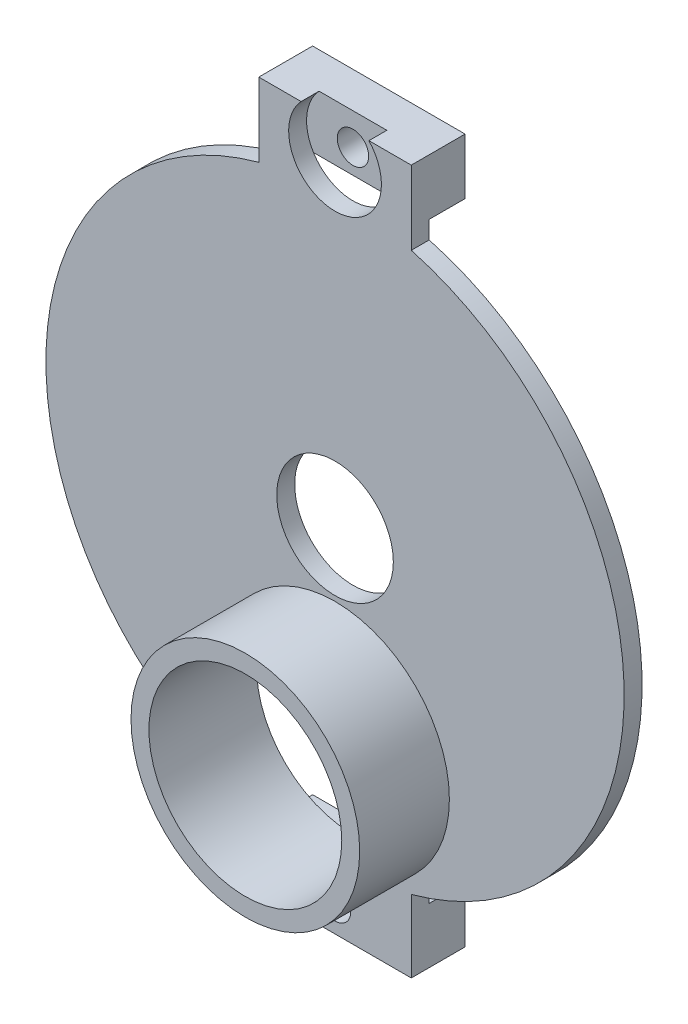
ISO-10303-21;
HEADER;
FILE_DESCRIPTION(('STEP AP214'),'2;1');
FILE_NAME('part.step','',(''),(''),'','','');
FILE_SCHEMA(('AUTOMOTIVE_DESIGN { 1 0 10303 214 1 1 1 1 }'));
ENDSEC;
DATA;
#1=APPLICATION_CONTEXT('core data for automotive mechanical design processes');
#2=APPLICATION_PROTOCOL_DEFINITION('international standard','automotive_design',2000,#1);
#3=PRODUCT_CONTEXT('',#1,'mechanical');
#4=PRODUCT('Part','Part','',(#3));
#5=PRODUCT_RELATED_PRODUCT_CATEGORY('part','',(#4));
#6=PRODUCT_DEFINITION_FORMATION('','',#4);
#7=PRODUCT_DEFINITION_CONTEXT('part definition',#1,'design');
#8=PRODUCT_DEFINITION('design','',#6,#7);
#9=PRODUCT_DEFINITION_SHAPE('','',#8);
#10=(LENGTH_UNIT() NAMED_UNIT(*) SI_UNIT(.MILLI.,.METRE.));
#11=(NAMED_UNIT(*) PLANE_ANGLE_UNIT() SI_UNIT($,.RADIAN.));
#12=(NAMED_UNIT(*) SI_UNIT($,.STERADIAN.) SOLID_ANGLE_UNIT());
#13=UNCERTAINTY_MEASURE_WITH_UNIT(LENGTH_MEASURE(1.E-05),#10,'distance_accuracy_value','');
#14=(GEOMETRIC_REPRESENTATION_CONTEXT(3) GLOBAL_UNCERTAINTY_ASSIGNED_CONTEXT((#13)) GLOBAL_UNIT_ASSIGNED_CONTEXT((#10,
#11,#12)) REPRESENTATION_CONTEXT('',''));
#15=CARTESIAN_POINT('',(0.,0.,0.));
#16=DIRECTION('',(0.,0.,1.));
#17=DIRECTION('',(1.,0.,0.));
#18=AXIS2_PLACEMENT_3D('',#15,#16,#17);
#19=CARTESIAN_POINT('',(0.,-116.80235271561,4.));
#20=DIRECTION('',(0.,0.,-1.));
#21=DIRECTION('',(-1.,0.,0.));
#22=AXIS2_PLACEMENT_3D('',#19,#20,#21);
#23=CYLINDRICAL_SURFACE('',#22,1.75);
#24=CARTESIAN_POINT('',(0.,-116.80235271561,0.));
#25=DIRECTION('',(0.,0.,1.));
#26=DIRECTION('',(1.,0.,0.));
#27=AXIS2_PLACEMENT_3D('',#24,#25,#26);
#28=CIRCLE('',#27,1.75);
#29=CARTESIAN_POINT('',(1.74999999999999,-116.80235271561,0.));
#30=VERTEX_POINT('',#29);
#31=EDGE_CURVE('E196',#30,#30,#28,.T.);
#32=ORIENTED_EDGE('',*,*,#31,.F.);
#33=EDGE_LOOP('',(#32));
#34=FACE_BOUND('',#33,.T.);
#35=CARTESIAN_POINT('',(0.,-116.80235271561,4.));
#36=DIRECTION('',(0.,0.,1.));
#37=DIRECTION('',(1.,0.,0.));
#38=AXIS2_PLACEMENT_3D('',#35,#36,#37);
#39=CIRCLE('',#38,1.75);
#40=CARTESIAN_POINT('',(1.74999999999999,-116.80235271561,4.));
#41=VERTEX_POINT('',#40);
#42=EDGE_CURVE('E218',#41,#41,#39,.T.);
#43=ORIENTED_EDGE('',*,*,#42,.T.);
#44=EDGE_LOOP('',(#43));
#45=FACE_BOUND('',#44,.T.);
#46=ADVANCED_FACE('F40',(#34,#45),#23,.F.);
#47=CARTESIAN_POINT('',(0.,-152.596752449376,6.));
#48=DIRECTION('',(0.,0.,1.));
#49=DIRECTION('',(1.,0.,0.));
#50=AXIS2_PLACEMENT_3D('',#47,#48,#49);
#51=PLANE('',#50);
#52=CARTESIAN_POINT('',(0.,-116.80235271561,6.));
#53=DIRECTION('',(0.,0.,1.));
#54=DIRECTION('',(1.,0.,0.));
#55=AXIS2_PLACEMENT_3D('',#52,#53,#54);
#56=CIRCLE('',#55,5.17155873195874);
#57=CARTESIAN_POINT('',(-3.77892763310191,-113.271810878742,6.));
#58=VERTEX_POINT('',#57);
#59=CARTESIAN_POINT('',(3.77892763310189,-113.271810878742,6.));
#60=VERTEX_POINT('',#59);
#61=EDGE_CURVE('E147',#58,#60,#56,.T.);
#62=ORIENTED_EDGE('',*,*,#61,.F.);
#63=DIRECTION('',(-1.,0.,0.));
#64=VECTOR('',#63,1.);
#65=CARTESIAN_POINT('',(-8.5,-113.271810878742,6.));
#66=LINE('',#65,#64);
#67=CARTESIAN_POINT('',(-8.5,-113.271810878742,6.));
#68=VERTEX_POINT('',#67);
#69=EDGE_CURVE('E167',#58,#68,#66,.T.);
#70=ORIENTED_EDGE('',*,*,#69,.T.);
#71=DIRECTION('',(0.,-1.,0.));
#72=VECTOR('',#71,1.);
#73=CARTESIAN_POINT('',(-8.5,-113.271810878742,6.));
#74=LINE('',#73,#72);
#75=CARTESIAN_POINT('',(-8.5,-121.500854119937,6.));
#76=VERTEX_POINT('',#75);
#77=EDGE_CURVE('E166',#68,#76,#74,.T.);
#78=ORIENTED_EDGE('',*,*,#77,.T.);
#79=CARTESIAN_POINT('',(0.,-152.596752449376,6.));
#80=DIRECTION('',(0.,0.,1.));
#81=DIRECTION('',(1.,0.,0.));
#82=AXIS2_PLACEMENT_3D('',#79,#80,#81);
#83=CIRCLE('',#82,32.2367010240625);
#84=CARTESIAN_POINT('',(-8.5,-183.692650778814,6.));
#85=VERTEX_POINT('',#84);
#86=EDGE_CURVE('E227',#76,#85,#83,.T.);
#87=ORIENTED_EDGE('',*,*,#86,.T.);
#88=DIRECTION('',(0.,-1.,0.));
#89=VECTOR('',#88,1.);
#90=CARTESIAN_POINT('',(-8.5,-191.764216674185,6.));
#91=LINE('',#90,#89);
#92=CARTESIAN_POINT('',(-8.5,-191.764216674185,6.));
#93=VERTEX_POINT('',#92);
#94=EDGE_CURVE('E239',#85,#93,#91,.T.);
#95=ORIENTED_EDGE('',*,*,#94,.T.);
#96=DIRECTION('',(1.,0.,0.));
#97=VECTOR('',#96,1.);
#98=CARTESIAN_POINT('',(8.5,-191.764216674185,6.));
#99=LINE('',#98,#97);
#100=CARTESIAN_POINT('',(8.5,-191.764216674185,6.));
#101=VERTEX_POINT('',#100);
#102=EDGE_CURVE('E241',#93,#101,#99,.T.);
#103=ORIENTED_EDGE('',*,*,#102,.T.);
#104=DIRECTION('',(0.,1.,0.));
#105=VECTOR('',#104,1.);
#106=CARTESIAN_POINT('',(8.5,-191.764216674185,6.));
#107=LINE('',#106,#105);
#108=CARTESIAN_POINT('',(8.50000000000001,-183.692650778814,6.));
#109=VERTEX_POINT('',#108);
#110=EDGE_CURVE('E247',#101,#109,#107,.T.);
#111=ORIENTED_EDGE('',*,*,#110,.T.);
#112=CARTESIAN_POINT('',(0.,-152.596752449376,6.));
#113=DIRECTION('',(0.,0.,1.));
#114=DIRECTION('',(1.,0.,0.));
#115=AXIS2_PLACEMENT_3D('',#112,#113,#114);
#116=CIRCLE('',#115,32.2367010240625);
#117=CARTESIAN_POINT('',(8.5,-121.500854119937,6.));
#118=VERTEX_POINT('',#117);
#119=EDGE_CURVE('E248',#109,#118,#116,.T.);
#120=ORIENTED_EDGE('',*,*,#119,.T.);
#121=DIRECTION('',(0.,1.,0.));
#122=VECTOR('',#121,1.);
#123=CARTESIAN_POINT('',(8.5,-113.271810878742,6.));
#124=LINE('',#123,#122);
#125=CARTESIAN_POINT('',(8.5,-113.271810878742,6.));
#126=VERTEX_POINT('',#125);
#127=EDGE_CURVE('E165',#118,#126,#124,.T.);
#128=ORIENTED_EDGE('',*,*,#127,.T.);
#129=EDGE_CURVE('E159',#126,#60,#66,.T.);
#130=ORIENTED_EDGE('',*,*,#129,.T.);
#131=EDGE_LOOP('',(#62,#70,#78,#87,#95,#103,#111,#120,#128,#130));
#132=FACE_BOUND('',#131,.T.);
#133=CARTESIAN_POINT('',(0.,-188.764216674185,6.));
#134=DIRECTION('',(0.,0.,1.));
#135=DIRECTION('',(1.,0.,0.));
#136=AXIS2_PLACEMENT_3D('',#133,#134,#135);
#137=CIRCLE('',#136,1.75);
#138=CARTESIAN_POINT('',(1.74999999999996,-188.764216674185,6.));
#139=VERTEX_POINT('',#138);
#140=EDGE_CURVE('E309',#139,#139,#137,.T.);
#141=ORIENTED_EDGE('',*,*,#140,.F.);
#142=EDGE_LOOP('',(#141));
#143=FACE_BOUND('',#142,.T.);
#144=CARTESIAN_POINT('',(0.,-152.596752449376,6.));
#145=DIRECTION('',(0.,0.,1.));
#146=DIRECTION('',(1.,0.,0.));
#147=AXIS2_PLACEMENT_3D('',#144,#145,#146);
#148=CIRCLE('',#147,6.5);
#149=CARTESIAN_POINT('',(6.49999999999992,-152.596752449376,6.));
#150=VERTEX_POINT('',#149);
#151=EDGE_CURVE('E352',#150,#150,#148,.T.);
#152=ORIENTED_EDGE('',*,*,#151,.F.);
#153=EDGE_LOOP('',(#152));
#154=FACE_BOUND('',#153,.T.);
#155=CARTESIAN_POINT('',(0.,-172.399709936052,6.));
#156=DIRECTION('',(0.,0.,1.));
#157=DIRECTION('',(1.,0.,0.));
#158=AXIS2_PLACEMENT_3D('',#155,#156,#157);
#159=CIRCLE('',#158,12.75);
#160=CARTESIAN_POINT('',(12.75,-172.399709936052,6.));
#161=VERTEX_POINT('',#160);
#162=EDGE_CURVE('E343',#161,#161,#159,.T.);
#163=ORIENTED_EDGE('',*,*,#162,.F.);
#164=EDGE_LOOP('',(#163));
#165=FACE_BOUND('',#164,.T.);
#166=ADVANCED_FACE('F162',(#132,#143,#154,#165),#51,.T.);
#167=CARTESIAN_POINT('',(0.,-152.596752449376,4.));
#168=DIRECTION('',(0.,0.,1.));
#169=DIRECTION('',(1.,0.,0.));
#170=AXIS2_PLACEMENT_3D('',#167,#168,#169);
#171=PLANE('',#170);
#172=CARTESIAN_POINT('',(0.,-152.596752449376,4.));
#173=DIRECTION('',(0.,0.,1.));
#174=DIRECTION('',(1.,0.,0.));
#175=AXIS2_PLACEMENT_3D('',#172,#173,#174);
#176=CIRCLE('',#175,6.5);
#177=CARTESIAN_POINT('',(6.49999999999992,-152.596752449376,4.));
#178=VERTEX_POINT('',#177);
#179=EDGE_CURVE('E355',#178,#178,#176,.T.);
#180=ORIENTED_EDGE('',*,*,#179,.T.);
#181=EDGE_LOOP('',(#180));
#182=FACE_BOUND('',#181,.T.);
#183=CARTESIAN_POINT('',(0.,-172.399709936052,4.));
#184=DIRECTION('',(0.,0.,1.));
#185=DIRECTION('',(1.,0.,0.));
#186=AXIS2_PLACEMENT_3D('',#183,#184,#185);
#187=CIRCLE('',#186,10.75);
#188=CARTESIAN_POINT('',(10.75,-172.399709936052,4.));
#189=VERTEX_POINT('',#188);
#190=EDGE_CURVE('E178',#189,#189,#187,.T.);
#191=ORIENTED_EDGE('',*,*,#190,.T.);
#192=EDGE_LOOP('',(#191));
#193=FACE_BOUND('',#192,.T.);
#194=DIRECTION('',(1.,0.,0.));
#195=VECTOR('',#194,1.);
#196=CARTESIAN_POINT('',(-8.5,-119.509704073762,4.));
#197=LINE('',#196,#195);
#198=CARTESIAN_POINT('',(-8.5,-119.509704073762,4.));
#199=VERTEX_POINT('',#198);
#200=CARTESIAN_POINT('',(-4.40627601741147,-119.509704073762,4.));
#201=VERTEX_POINT('',#200);
#202=EDGE_CURVE('E205',#199,#201,#197,.T.);
#203=ORIENTED_EDGE('',*,*,#202,.T.);
#204=CARTESIAN_POINT('',(0.,-116.80235271561,4.));
#205=DIRECTION('',(0.,0.,1.));
#206=DIRECTION('',(1.,0.,0.));
#207=AXIS2_PLACEMENT_3D('',#204,#205,#206);
#208=CIRCLE('',#207,5.17155873195874);
#209=CARTESIAN_POINT('',(4.40627601741145,-119.509704073762,4.));
#210=VERTEX_POINT('',#209);
#211=EDGE_CURVE('E287',#201,#210,#208,.T.);
#212=ORIENTED_EDGE('',*,*,#211,.T.);
#213=CARTESIAN_POINT('',(8.5,-119.509704073762,4.));
#214=VERTEX_POINT('',#213);
#215=EDGE_CURVE('E44',#210,#214,#197,.T.);
#216=ORIENTED_EDGE('',*,*,#215,.T.);
#217=DIRECTION('',(0.,1.,0.));
#218=VECTOR('',#217,1.);
#219=CARTESIAN_POINT('',(8.5,-113.271810878742,4.));
#220=LINE('',#219,#218);
#221=CARTESIAN_POINT('',(8.5,-121.500854119937,4.));
#222=VERTEX_POINT('',#221);
#223=EDGE_CURVE('E185',#222,#214,#220,.T.);
#224=ORIENTED_EDGE('',*,*,#223,.F.);
#225=CARTESIAN_POINT('',(0.,-152.596752449376,4.));
#226=DIRECTION('',(0.,0.,1.));
#227=DIRECTION('',(1.,0.,0.));
#228=AXIS2_PLACEMENT_3D('',#225,#226,#227);
#229=CIRCLE('',#228,32.2367010240625);
#230=CARTESIAN_POINT('',(8.50000000000001,-183.692650778814,4.));
#231=VERTEX_POINT('',#230);
#232=EDGE_CURVE('E183',#231,#222,#229,.T.);
#233=ORIENTED_EDGE('',*,*,#232,.F.);
#234=DIRECTION('',(0.,1.,0.));
#235=VECTOR('',#234,1.);
#236=CARTESIAN_POINT('',(8.5,-191.764216674185,4.));
#237=LINE('',#236,#235);
#238=CARTESIAN_POINT('',(8.5,-185.563577972153,4.));
#239=VERTEX_POINT('',#238);
#240=EDGE_CURVE('E181',#239,#231,#237,.T.);
#241=ORIENTED_EDGE('',*,*,#240,.F.);
#242=DIRECTION('',(-1.,0.,0.));
#243=VECTOR('',#242,1.);
#244=CARTESIAN_POINT('',(8.5,-185.563577972153,4.));
#245=LINE('',#244,#243);
#246=CARTESIAN_POINT('',(-8.5,-185.563577972153,4.));
#247=VERTEX_POINT('',#246);
#248=EDGE_CURVE('E291',#239,#247,#245,.T.);
#249=ORIENTED_EDGE('',*,*,#248,.T.);
#250=DIRECTION('',(0.,-1.,0.));
#251=VECTOR('',#250,1.);
#252=CARTESIAN_POINT('',(-8.5,-191.764216674185,4.));
#253=LINE('',#252,#251);
#254=CARTESIAN_POINT('',(-8.5,-183.692650778814,4.));
#255=VERTEX_POINT('',#254);
#256=EDGE_CURVE('E177',#255,#247,#253,.T.);
#257=ORIENTED_EDGE('',*,*,#256,.F.);
#258=CARTESIAN_POINT('',(0.,-152.596752449376,4.));
#259=DIRECTION('',(0.,0.,1.));
#260=DIRECTION('',(1.,0.,0.));
#261=AXIS2_PLACEMENT_3D('',#258,#259,#260);
#262=CIRCLE('',#261,32.2367010240625);
#263=CARTESIAN_POINT('',(-8.5,-121.500854119937,4.));
#264=VERTEX_POINT('',#263);
#265=EDGE_CURVE('E174',#264,#255,#262,.T.);
#266=ORIENTED_EDGE('',*,*,#265,.F.);
#267=DIRECTION('',(0.,-1.,0.));
#268=VECTOR('',#267,1.);
#269=CARTESIAN_POINT('',(-8.5,-113.271810878742,4.));
#270=LINE('',#269,#268);
#271=EDGE_CURVE('E194',#199,#264,#270,.T.);
#272=ORIENTED_EDGE('',*,*,#271,.F.);
#273=EDGE_LOOP('',(#203,#212,#216,#224,#233,#241,#249,#257,#266,#272));
#274=FACE_BOUND('',#273,.T.);
#275=ADVANCED_FACE('F286',(#182,#193,#274),#171,.F.);
#276=CARTESIAN_POINT('',(0.,0.,0.));
#277=DIRECTION('',(0.,0.,1.));
#278=DIRECTION('',(1.,0.,0.));
#279=AXIS2_PLACEMENT_3D('',#276,#277,#278);
#280=PLANE('',#279);
#281=DIRECTION('',(0.,-1.,0.));
#282=VECTOR('',#281,1.);
#283=CARTESIAN_POINT('',(-8.5,-113.271810878742,0.));
#284=LINE('',#283,#282);
#285=CARTESIAN_POINT('',(-8.5,-113.271810878742,0.));
#286=VERTEX_POINT('',#285);
#287=CARTESIAN_POINT('',(-8.5,-119.509704073762,0.));
#288=VERTEX_POINT('',#287);
#289=EDGE_CURVE('E198',#286,#288,#284,.T.);
#290=ORIENTED_EDGE('',*,*,#289,.F.);
#291=DIRECTION('',(-1.,0.,0.));
#292=VECTOR('',#291,1.);
#293=CARTESIAN_POINT('',(-8.5,-113.271810878742,0.));
#294=LINE('',#293,#292);
#295=CARTESIAN_POINT('',(8.5,-113.271810878742,0.));
#296=VERTEX_POINT('',#295);
#297=EDGE_CURVE('E271',#296,#286,#294,.T.);
#298=ORIENTED_EDGE('',*,*,#297,.F.);
#299=DIRECTION('',(0.,1.,0.));
#300=VECTOR('',#299,1.);
#301=CARTESIAN_POINT('',(8.5,-113.271810878742,0.));
#302=LINE('',#301,#300);
#303=CARTESIAN_POINT('',(8.5,-119.509704073762,0.));
#304=VERTEX_POINT('',#303);
#305=EDGE_CURVE('E266',#304,#296,#302,.T.);
#306=ORIENTED_EDGE('',*,*,#305,.F.);
#307=DIRECTION('',(1.,0.,0.));
#308=VECTOR('',#307,1.);
#309=CARTESIAN_POINT('',(-8.5,-119.509704073762,0.));
#310=LINE('',#309,#308);
#311=EDGE_CURVE('E273',#288,#304,#310,.T.);
#312=ORIENTED_EDGE('',*,*,#311,.F.);
#313=EDGE_LOOP('',(#290,#298,#306,#312));
#314=FACE_BOUND('',#313,.T.);
#315=ORIENTED_EDGE('',*,*,#31,.T.);
#316=EDGE_LOOP('',(#315));
#317=FACE_BOUND('',#316,.T.);
#318=ADVANCED_FACE('F278',(#314,#317),#280,.F.);
#319=CARTESIAN_POINT('',(-8.5,-113.271810878742,4.));
#320=DIRECTION('',(1.,0.,0.));
#321=DIRECTION('',(0.,0.,-1.));
#322=AXIS2_PLACEMENT_3D('',#319,#320,#321);
#323=PLANE('',#322);
#324=ORIENTED_EDGE('',*,*,#289,.T.);
#325=DIRECTION('',(0.,0.,-1.));
#326=VECTOR('',#325,1.);
#327=CARTESIAN_POINT('',(-8.5,-119.509704073762,4.));
#328=LINE('',#327,#326);
#329=EDGE_CURVE('E212',#199,#288,#328,.T.);
#330=ORIENTED_EDGE('',*,*,#329,.F.);
#331=ORIENTED_EDGE('',*,*,#271,.T.);
#332=DIRECTION('',(0.,0.,-1.));
#333=VECTOR('',#332,1.);
#334=CARTESIAN_POINT('',(-8.5,-121.500854119937,6.));
#335=LINE('',#334,#333);
#336=EDGE_CURVE('E169',#76,#264,#335,.T.);
#337=ORIENTED_EDGE('',*,*,#336,.F.);
#338=ORIENTED_EDGE('',*,*,#77,.F.);
#339=DIRECTION('',(0.,0.,-1.));
#340=VECTOR('',#339,1.);
#341=CARTESIAN_POINT('',(-8.5,-113.271810878742,4.));
#342=LINE('',#341,#340);
#343=EDGE_CURVE('E209',#68,#286,#342,.T.);
#344=ORIENTED_EDGE('',*,*,#343,.T.);
#345=EDGE_LOOP('',(#324,#330,#331,#337,#338,#344));
#346=FACE_BOUND('',#345,.T.);
#347=ADVANCED_FACE('F42',(#346),#323,.F.);
#348=CARTESIAN_POINT('',(-8.5,-119.509704073762,4.));
#349=DIRECTION('',(0.,1.,0.));
#350=DIRECTION('',(0.,0.,1.));
#351=AXIS2_PLACEMENT_3D('',#348,#349,#350);
#352=PLANE('',#351);
#353=ORIENTED_EDGE('',*,*,#311,.T.);
#354=DIRECTION('',(0.,0.,-1.));
#355=VECTOR('',#354,1.);
#356=CARTESIAN_POINT('',(8.5,-119.509704073762,4.));
#357=LINE('',#356,#355);
#358=EDGE_CURVE('E215',#214,#304,#357,.T.);
#359=ORIENTED_EDGE('',*,*,#358,.F.);
#360=ORIENTED_EDGE('',*,*,#215,.F.);
#361=DIRECTION('',(1.,0.,0.));
#362=VECTOR('',#361,1.);
#363=CARTESIAN_POINT('',(-8.5,-119.509704073762,4.));
#364=LINE('',#363,#362);
#365=EDGE_CURVE('E283',#201,#210,#364,.T.);
#366=ORIENTED_EDGE('',*,*,#365,.F.);
#367=ORIENTED_EDGE('',*,*,#202,.F.);
#368=ORIENTED_EDGE('',*,*,#329,.T.);
#369=EDGE_LOOP('',(#353,#359,#360,#366,#367,#368));
#370=FACE_BOUND('',#369,.T.);
#371=ADVANCED_FACE('F280',(#370),#352,.F.);
#372=CARTESIAN_POINT('',(8.5,-113.271810878742,4.));
#373=DIRECTION('',(-1.,0.,0.));
#374=DIRECTION('',(0.,0.,1.));
#375=AXIS2_PLACEMENT_3D('',#372,#373,#374);
#376=PLANE('',#375);
#377=ORIENTED_EDGE('',*,*,#305,.T.);
#378=DIRECTION('',(0.,0.,-1.));
#379=VECTOR('',#378,1.);
#380=CARTESIAN_POINT('',(8.5,-113.271810878742,4.));
#381=LINE('',#380,#379);
#382=EDGE_CURVE('E263',#126,#296,#381,.T.);
#383=ORIENTED_EDGE('',*,*,#382,.F.);
#384=ORIENTED_EDGE('',*,*,#127,.F.);
#385=DIRECTION('',(0.,0.,-1.));
#386=VECTOR('',#385,1.);
#387=CARTESIAN_POINT('',(8.5,-121.500854119937,6.));
#388=LINE('',#387,#386);
#389=EDGE_CURVE('E236',#118,#222,#388,.T.);
#390=ORIENTED_EDGE('',*,*,#389,.T.);
#391=ORIENTED_EDGE('',*,*,#223,.T.);
#392=ORIENTED_EDGE('',*,*,#358,.T.);
#393=EDGE_LOOP('',(#377,#383,#384,#390,#391,#392));
#394=FACE_BOUND('',#393,.T.);
#395=ADVANCED_FACE('F262',(#394),#376,.F.);
#396=CARTESIAN_POINT('',(-8.5,-113.271810878742,4.));
#397=DIRECTION('',(0.,-1.,0.));
#398=DIRECTION('',(0.,0.,-1.));
#399=AXIS2_PLACEMENT_3D('',#396,#397,#398);
#400=PLANE('',#399);
#401=DIRECTION('',(-1.,0.,0.));
#402=VECTOR('',#401,1.);
#403=CARTESIAN_POINT('',(-8.5,-113.271810878742,4.));
#404=LINE('',#403,#402);
#405=CARTESIAN_POINT('',(3.77892763310189,-113.271810878742,4.));
#406=VERTEX_POINT('',#405);
#407=CARTESIAN_POINT('',(-3.77892763310191,-113.271810878742,4.));
#408=VERTEX_POINT('',#407);
#409=EDGE_CURVE('E160',#406,#408,#404,.T.);
#410=ORIENTED_EDGE('',*,*,#409,.F.);
#411=DIRECTION('',(0.,0.,1.));
#412=VECTOR('',#411,1.);
#413=CARTESIAN_POINT('',(3.77892763310189,-113.271810878742,4.));
#414=LINE('',#413,#412);
#415=EDGE_CURVE('E12',#406,#60,#414,.T.);
#416=ORIENTED_EDGE('',*,*,#415,.T.);
#417=ORIENTED_EDGE('',*,*,#129,.F.);
#418=ORIENTED_EDGE('',*,*,#382,.T.);
#419=ORIENTED_EDGE('',*,*,#297,.T.);
#420=ORIENTED_EDGE('',*,*,#343,.F.);
#421=ORIENTED_EDGE('',*,*,#69,.F.);
#422=DIRECTION('',(0.,0.,1.));
#423=VECTOR('',#422,1.);
#424=CARTESIAN_POINT('',(-3.77892763310191,-113.271810878742,4.));
#425=LINE('',#424,#423);
#426=EDGE_CURVE('E50',#58,#408,#425,.F.);
#427=ORIENTED_EDGE('',*,*,#426,.T.);
#428=EDGE_LOOP('',(#410,#416,#417,#418,#419,#420,#421,#427));
#429=FACE_BOUND('',#428,.T.);
#430=ADVANCED_FACE('F157',(#429),#400,.F.);
#431=CARTESIAN_POINT('',(0.,-152.596752449376,6.));
#432=DIRECTION('',(0.,0.,-1.));
#433=DIRECTION('',(-1.,0.,0.));
#434=AXIS2_PLACEMENT_3D('',#431,#432,#433);
#435=CYLINDRICAL_SURFACE('',#434,32.2367010240625);
#436=ORIENTED_EDGE('',*,*,#265,.T.);
#437=DIRECTION('',(0.,0.,-1.));
#438=VECTOR('',#437,1.);
#439=CARTESIAN_POINT('',(-8.5,-183.692650778814,6.));
#440=LINE('',#439,#438);
#441=EDGE_CURVE('E199',#85,#255,#440,.T.);
#442=ORIENTED_EDGE('',*,*,#441,.F.);
#443=ORIENTED_EDGE('',*,*,#86,.F.);
#444=ORIENTED_EDGE('',*,*,#336,.T.);
#445=EDGE_LOOP('',(#436,#442,#443,#444));
#446=FACE_BOUND('',#445,.T.);
#447=ADVANCED_FACE('F237',(#446),#435,.T.);
#448=CARTESIAN_POINT('',(-8.5,-191.764216674185,6.));
#449=DIRECTION('',(1.,0.,0.));
#450=DIRECTION('',(0.,1.,0.));
#451=AXIS2_PLACEMENT_3D('',#448,#449,#450);
#452=PLANE('',#451);
#453=ORIENTED_EDGE('',*,*,#256,.T.);
#454=DIRECTION('',(0.,0.,-1.));
#455=VECTOR('',#454,1.);
#456=CARTESIAN_POINT('',(-8.5,-185.563577972153,4.));
#457=LINE('',#456,#455);
#458=CARTESIAN_POINT('',(-8.5,-185.563577972153,0.));
#459=VERTEX_POINT('',#458);
#460=EDGE_CURVE('E310',#247,#459,#457,.T.);
#461=ORIENTED_EDGE('',*,*,#460,.T.);
#462=DIRECTION('',(0.,-1.,0.));
#463=VECTOR('',#462,1.);
#464=CARTESIAN_POINT('',(-8.5,-191.764216674185,0.));
#465=LINE('',#464,#463);
#466=CARTESIAN_POINT('',(-8.5,-191.764216674185,0.));
#467=VERTEX_POINT('',#466);
#468=EDGE_CURVE('E317',#459,#467,#465,.T.);
#469=ORIENTED_EDGE('',*,*,#468,.T.);
#470=DIRECTION('',(0.,0.,-1.));
#471=VECTOR('',#470,1.);
#472=CARTESIAN_POINT('',(-8.5,-191.764216674185,6.));
#473=LINE('',#472,#471);
#474=EDGE_CURVE('E296',#93,#467,#473,.T.);
#475=ORIENTED_EDGE('',*,*,#474,.F.);
#476=ORIENTED_EDGE('',*,*,#94,.F.);
#477=ORIENTED_EDGE('',*,*,#441,.T.);
#478=EDGE_LOOP('',(#453,#461,#469,#475,#476,#477));
#479=FACE_BOUND('',#478,.T.);
#480=ADVANCED_FACE('F294',(#479),#452,.F.);
#481=CARTESIAN_POINT('',(8.5,-191.764216674185,6.));
#482=DIRECTION('',(0.,1.,0.));
#483=DIRECTION('',(0.,0.,1.));
#484=AXIS2_PLACEMENT_3D('',#481,#482,#483);
#485=PLANE('',#484);
#486=ORIENTED_EDGE('',*,*,#474,.T.);
#487=DIRECTION('',(1.,0.,0.));
#488=VECTOR('',#487,1.);
#489=CARTESIAN_POINT('',(8.5,-191.764216674185,0.));
#490=LINE('',#489,#488);
#491=CARTESIAN_POINT('',(8.5,-191.764216674185,0.));
#492=VERTEX_POINT('',#491);
#493=EDGE_CURVE('E313',#467,#492,#490,.T.);
#494=ORIENTED_EDGE('',*,*,#493,.T.);
#495=DIRECTION('',(0.,0.,-1.));
#496=VECTOR('',#495,1.);
#497=CARTESIAN_POINT('',(8.5,-191.764216674185,6.));
#498=LINE('',#497,#496);
#499=EDGE_CURVE('E297',#101,#492,#498,.T.);
#500=ORIENTED_EDGE('',*,*,#499,.F.);
#501=ORIENTED_EDGE('',*,*,#102,.F.);
#502=EDGE_LOOP('',(#486,#494,#500,#501));
#503=FACE_BOUND('',#502,.T.);
#504=ADVANCED_FACE('F490',(#503),#485,.F.);
#505=CARTESIAN_POINT('',(8.5,-191.764216674185,6.));
#506=DIRECTION('',(-1.,0.,0.));
#507=DIRECTION('',(0.,-1.,0.));
#508=AXIS2_PLACEMENT_3D('',#505,#506,#507);
#509=PLANE('',#508);
#510=ORIENTED_EDGE('',*,*,#499,.T.);
#511=DIRECTION('',(0.,1.,0.));
#512=VECTOR('',#511,1.);
#513=CARTESIAN_POINT('',(8.5,-191.764216674185,0.));
#514=LINE('',#513,#512);
#515=CARTESIAN_POINT('',(8.5,-185.563577972153,0.));
#516=VERTEX_POINT('',#515);
#517=EDGE_CURVE('E307',#492,#516,#514,.T.);
#518=ORIENTED_EDGE('',*,*,#517,.T.);
#519=DIRECTION('',(0.,0.,-1.));
#520=VECTOR('',#519,1.);
#521=CARTESIAN_POINT('',(8.5,-185.563577972153,4.));
#522=LINE('',#521,#520);
#523=EDGE_CURVE('E305',#239,#516,#522,.T.);
#524=ORIENTED_EDGE('',*,*,#523,.F.);
#525=ORIENTED_EDGE('',*,*,#240,.T.);
#526=DIRECTION('',(0.,0.,-1.));
#527=VECTOR('',#526,1.);
#528=CARTESIAN_POINT('',(8.50000000000001,-183.692650778814,6.));
#529=LINE('',#528,#527);
#530=EDGE_CURVE('E260',#109,#231,#529,.T.);
#531=ORIENTED_EDGE('',*,*,#530,.F.);
#532=ORIENTED_EDGE('',*,*,#110,.F.);
#533=EDGE_LOOP('',(#510,#518,#524,#525,#531,#532));
#534=FACE_BOUND('',#533,.T.);
#535=ADVANCED_FACE('F302',(#534),#509,.F.);
#536=CARTESIAN_POINT('',(0.,-152.596752449376,6.));
#537=DIRECTION('',(0.,0.,-1.));
#538=DIRECTION('',(-1.,0.,0.));
#539=AXIS2_PLACEMENT_3D('',#536,#537,#538);
#540=CYLINDRICAL_SURFACE('',#539,32.2367010240625);
#541=ORIENTED_EDGE('',*,*,#232,.T.);
#542=ORIENTED_EDGE('',*,*,#389,.F.);
#543=ORIENTED_EDGE('',*,*,#119,.F.);
#544=ORIENTED_EDGE('',*,*,#530,.T.);
#545=EDGE_LOOP('',(#541,#542,#543,#544));
#546=FACE_BOUND('',#545,.T.);
#547=ADVANCED_FACE('F256',(#546),#540,.T.);
#548=CARTESIAN_POINT('',(0.,-172.399709936052,6.));
#549=DIRECTION('',(0.,0.,-1.));
#550=DIRECTION('',(-1.,0.,0.));
#551=AXIS2_PLACEMENT_3D('',#548,#549,#550);
#552=CYLINDRICAL_SURFACE('',#551,10.75);
#553=ORIENTED_EDGE('',*,*,#190,.F.);
#554=EDGE_LOOP('',(#553));
#555=FACE_BOUND('',#554,.T.);
#556=CARTESIAN_POINT('',(0.,-172.399709936052,16.));
#557=DIRECTION('',(0.,0.,1.));
#558=DIRECTION('',(1.,0.,0.));
#559=AXIS2_PLACEMENT_3D('',#556,#557,#558);
#560=CIRCLE('',#559,10.75);
#561=CARTESIAN_POINT('',(10.75,-172.399709936052,16.));
#562=VERTEX_POINT('',#561);
#563=EDGE_CURVE('E341',#562,#562,#560,.T.);
#564=ORIENTED_EDGE('',*,*,#563,.T.);
#565=EDGE_LOOP('',(#564));
#566=FACE_BOUND('',#565,.T.);
#567=ADVANCED_FACE('F334',(#555,#566),#552,.F.);
#568=CARTESIAN_POINT('',(0.,-188.764216674185,6.));
#569=DIRECTION('',(0.,0.,-1.));
#570=DIRECTION('',(-1.,0.,0.));
#571=AXIS2_PLACEMENT_3D('',#568,#569,#570);
#572=CYLINDRICAL_SURFACE('',#571,1.75);
#573=ORIENTED_EDGE('',*,*,#140,.T.);
#574=EDGE_LOOP('',(#573));
#575=FACE_BOUND('',#574,.T.);
#576=CARTESIAN_POINT('',(0.,-188.764216674185,0.));
#577=DIRECTION('',(0.,0.,1.));
#578=DIRECTION('',(1.,0.,0.));
#579=AXIS2_PLACEMENT_3D('',#576,#577,#578);
#580=CIRCLE('',#579,1.75);
#581=CARTESIAN_POINT('',(1.74999999999996,-188.764216674185,0.));
#582=VERTEX_POINT('',#581);
#583=EDGE_CURVE('E321',#582,#582,#580,.T.);
#584=ORIENTED_EDGE('',*,*,#583,.F.);
#585=EDGE_LOOP('',(#584));
#586=FACE_BOUND('',#585,.T.);
#587=ADVANCED_FACE('F337',(#575,#586),#572,.F.);
#588=CARTESIAN_POINT('',(0.,0.,0.));
#589=DIRECTION('',(0.,0.,1.));
#590=DIRECTION('',(1.,0.,0.));
#591=AXIS2_PLACEMENT_3D('',#588,#589,#590);
#592=PLANE('',#591);
#593=ORIENTED_EDGE('',*,*,#517,.F.);
#594=ORIENTED_EDGE('',*,*,#493,.F.);
#595=ORIENTED_EDGE('',*,*,#468,.F.);
#596=DIRECTION('',(-1.,0.,0.));
#597=VECTOR('',#596,1.);
#598=CARTESIAN_POINT('',(8.5,-185.563577972153,0.));
#599=LINE('',#598,#597);
#600=EDGE_CURVE('E324',#516,#459,#599,.T.);
#601=ORIENTED_EDGE('',*,*,#600,.F.);
#602=EDGE_LOOP('',(#593,#594,#595,#601));
#603=FACE_BOUND('',#602,.T.);
#604=ORIENTED_EDGE('',*,*,#583,.T.);
#605=EDGE_LOOP('',(#604));
#606=FACE_BOUND('',#605,.T.);
#607=ADVANCED_FACE('F362',(#603,#606),#592,.F.);
#608=CARTESIAN_POINT('',(8.5,-185.563577972153,4.));
#609=DIRECTION('',(0.,-1.,0.));
#610=DIRECTION('',(0.,0.,-1.));
#611=AXIS2_PLACEMENT_3D('',#608,#609,#610);
#612=PLANE('',#611);
#613=ORIENTED_EDGE('',*,*,#600,.T.);
#614=ORIENTED_EDGE('',*,*,#460,.F.);
#615=ORIENTED_EDGE('',*,*,#248,.F.);
#616=ORIENTED_EDGE('',*,*,#523,.T.);
#617=EDGE_LOOP('',(#613,#614,#615,#616));
#618=FACE_BOUND('',#617,.T.);
#619=ADVANCED_FACE('F312',(#618),#612,.F.);
#620=CARTESIAN_POINT('',(0.,-152.596752449376,-4.));
#621=DIRECTION('',(0.,0.,1.));
#622=DIRECTION('',(1.,0.,0.));
#623=AXIS2_PLACEMENT_3D('',#620,#621,#622);
#624=CYLINDRICAL_SURFACE('',#623,6.5);
#625=ORIENTED_EDGE('',*,*,#151,.T.);
#626=EDGE_LOOP('',(#625));
#627=FACE_BOUND('',#626,.T.);
#628=ORIENTED_EDGE('',*,*,#179,.F.);
#629=EDGE_LOOP('',(#628));
#630=FACE_BOUND('',#629,.T.);
#631=ADVANCED_FACE('F439',(#627,#630),#624,.F.);
#632=CARTESIAN_POINT('',(0.,-172.399709936052,16.));
#633=DIRECTION('',(0.,0.,1.));
#634=DIRECTION('',(1.,0.,0.));
#635=AXIS2_PLACEMENT_3D('',#632,#633,#634);
#636=PLANE('',#635);
#637=CARTESIAN_POINT('',(0.,-172.399709936052,16.));
#638=DIRECTION('',(0.,0.,1.));
#639=DIRECTION('',(1.,0.,0.));
#640=AXIS2_PLACEMENT_3D('',#637,#638,#639);
#641=CIRCLE('',#640,12.75);
#642=CARTESIAN_POINT('',(12.75,-172.399709936052,16.));
#643=VERTEX_POINT('',#642);
#644=EDGE_CURVE('E346',#643,#643,#641,.T.);
#645=ORIENTED_EDGE('',*,*,#644,.T.);
#646=EDGE_LOOP('',(#645));
#647=FACE_BOUND('',#646,.T.);
#648=ORIENTED_EDGE('',*,*,#563,.F.);
#649=EDGE_LOOP('',(#648));
#650=FACE_BOUND('',#649,.T.);
#651=ADVANCED_FACE('F428',(#647,#650),#636,.T.);
#652=CARTESIAN_POINT('',(0.,-172.399709936052,16.));
#653=DIRECTION('',(0.,0.,-1.));
#654=DIRECTION('',(-1.,0.,0.));
#655=AXIS2_PLACEMENT_3D('',#652,#653,#654);
#656=CYLINDRICAL_SURFACE('',#655,12.75);
#657=ORIENTED_EDGE('',*,*,#644,.F.);
#658=EDGE_LOOP('',(#657));
#659=FACE_BOUND('',#658,.T.);
#660=ORIENTED_EDGE('',*,*,#162,.T.);
#661=EDGE_LOOP('',(#660));
#662=FACE_BOUND('',#661,.T.);
#663=ADVANCED_FACE('F423',(#659,#662),#656,.T.);
#664=CARTESIAN_POINT('',(0.,-116.80235271561,4.));
#665=DIRECTION('',(0.,0.,1.));
#666=DIRECTION('',(1.,0.,0.));
#667=AXIS2_PLACEMENT_3D('',#664,#665,#666);
#668=CYLINDRICAL_SURFACE('',#667,5.17155873195874);
#669=EDGE_CURVE('E62',#210,#406,#208,.T.);
#670=ORIENTED_EDGE('',*,*,#669,.F.);
#671=ORIENTED_EDGE('',*,*,#211,.F.);
#672=EDGE_CURVE('E57',#408,#201,#208,.T.);
#673=ORIENTED_EDGE('',*,*,#672,.F.);
#674=ORIENTED_EDGE('',*,*,#426,.F.);
#675=ORIENTED_EDGE('',*,*,#61,.T.);
#676=ORIENTED_EDGE('',*,*,#415,.F.);
#677=EDGE_LOOP('',(#670,#671,#673,#674,#675,#676));
#678=FACE_BOUND('',#677,.T.);
#679=ADVANCED_FACE('F148',(#678),#668,.F.);
#680=CARTESIAN_POINT('',(0.,-116.80235271561,4.));
#681=DIRECTION('',(0.,0.,1.));
#682=DIRECTION('',(1.,0.,0.));
#683=AXIS2_PLACEMENT_3D('',#680,#681,#682);
#684=PLANE('',#683);
#685=ORIENTED_EDGE('',*,*,#42,.F.);
#686=EDGE_LOOP('',(#685));
#687=FACE_BOUND('',#686,.T.);
#688=ORIENTED_EDGE('',*,*,#365,.T.);
#689=ORIENTED_EDGE('',*,*,#669,.T.);
#690=ORIENTED_EDGE('',*,*,#409,.T.);
#691=ORIENTED_EDGE('',*,*,#672,.T.);
#692=EDGE_LOOP('',(#688,#689,#690,#691));
#693=FACE_BOUND('',#692,.T.);
#694=ADVANCED_FACE('F537',(#687,#693),#684,.T.);
#695=CLOSED_SHELL('',(#46,#166,#275,#318,#347,#371,#395,#430,#447,#480,#504,#535,#547,#567,#587,
#607,#619,#631,#651,#663,#679,#694));
#696=MANIFOLD_SOLID_BREP('B2',#695);
#697=ADVANCED_BREP_SHAPE_REPRESENTATION('',(#18,#696),#14);
#698=SHAPE_DEFINITION_REPRESENTATION(#9,#697);
ENDSEC;
END-ISO-10303-21;
